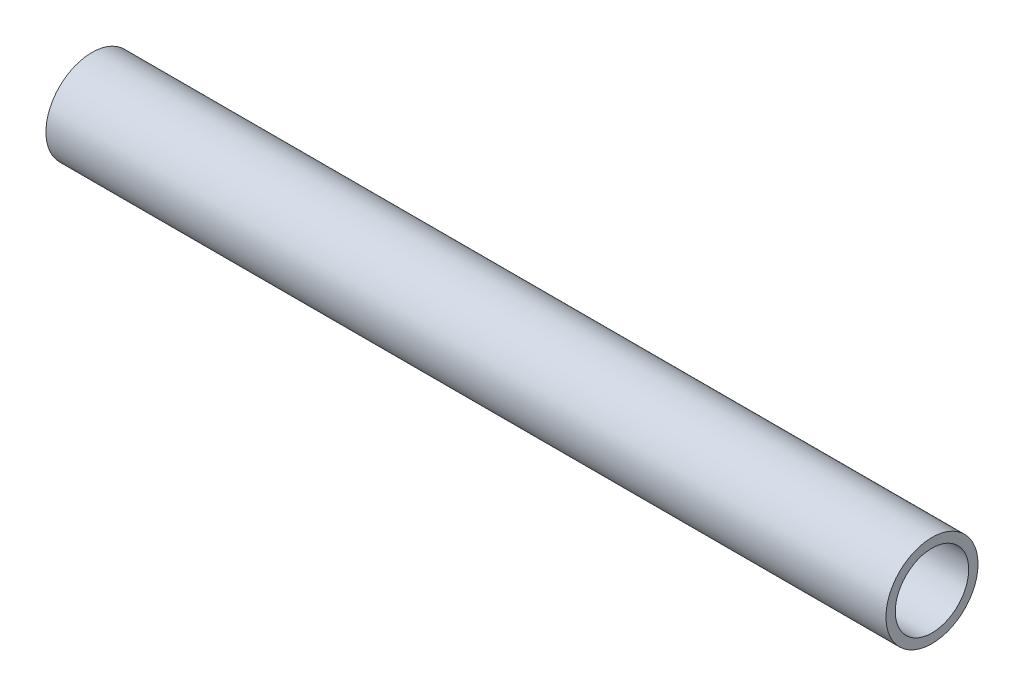
ISO-10303-21;
HEADER;
FILE_DESCRIPTION(('STEP AP214'),'2;1');
FILE_NAME('part.step','',(''),(''),'','','');
FILE_SCHEMA(('AUTOMOTIVE_DESIGN { 1 0 10303 214 1 1 1 1 }'));
ENDSEC;
DATA;
#1=APPLICATION_CONTEXT('core data for automotive mechanical design processes');
#2=APPLICATION_PROTOCOL_DEFINITION('international standard','automotive_design',2000,#1);
#3=PRODUCT_CONTEXT('',#1,'mechanical');
#4=PRODUCT('Part','Part','',(#3));
#5=PRODUCT_RELATED_PRODUCT_CATEGORY('part','',(#4));
#6=PRODUCT_DEFINITION_FORMATION('','',#4);
#7=PRODUCT_DEFINITION_CONTEXT('part definition',#1,'design');
#8=PRODUCT_DEFINITION('design','',#6,#7);
#9=PRODUCT_DEFINITION_SHAPE('','',#8);
#10=(LENGTH_UNIT() NAMED_UNIT(*) SI_UNIT(.MILLI.,.METRE.));
#11=(NAMED_UNIT(*) PLANE_ANGLE_UNIT() SI_UNIT($,.RADIAN.));
#12=(NAMED_UNIT(*) SI_UNIT($,.STERADIAN.) SOLID_ANGLE_UNIT());
#13=UNCERTAINTY_MEASURE_WITH_UNIT(LENGTH_MEASURE(1.E-05),#10,'distance_accuracy_value','');
#14=(GEOMETRIC_REPRESENTATION_CONTEXT(3) GLOBAL_UNCERTAINTY_ASSIGNED_CONTEXT((#13)) GLOBAL_UNIT_ASSIGNED_CONTEXT((#10,
#11,#12)) REPRESENTATION_CONTEXT('',''));
#15=CARTESIAN_POINT('',(0.,0.,0.));
#16=DIRECTION('',(0.,0.,1.));
#17=DIRECTION('',(1.,0.,0.));
#18=AXIS2_PLACEMENT_3D('',#15,#16,#17);
#19=CARTESIAN_POINT('',(0.,0.,-21.04263));
#20=DIRECTION('',(0.,0.,1.));
#21=DIRECTION('',(1.,0.,0.));
#22=AXIS2_PLACEMENT_3D('',#19,#20,#21);
#23=CYLINDRICAL_SURFACE('',#22,2.7051);
#24=CARTESIAN_POINT('',(2.7051,0.,-13.3223));
#25=CARTESIAN_POINT('',(2.705092770252,0.150134895986582,-13.322296453047));
#26=CARTESIAN_POINT('',(2.69254720896019,0.300455599655087,-13.3197336186402));
#27=CARTESIAN_POINT('',(2.64270335476511,0.596966096638184,-13.3097489860963));
#28=CARTESIAN_POINT('',(2.60535620334322,0.743147141080097,-13.3023175974179));
#29=CARTESIAN_POINT('',(2.50710998925604,1.02686798668373,-13.2834258688201));
#30=CARTESIAN_POINT('',(2.44624465733639,1.16441983725732,-13.2719713012418));
#31=CARTESIAN_POINT('',(2.30277724469893,1.4273083525318,-13.2462800387835));
#32=CARTESIAN_POINT('',(2.22018226779195,1.55264899098009,-13.2320442535243));
#33=CARTESIAN_POINT('',(2.03436150008406,1.78937507390252,-13.2021303510161));
#34=CARTESIAN_POINT('',(1.93088889645851,1.90056480475128,-13.1864363217807));
#35=CARTESIAN_POINT('',(1.70677569421369,2.10413997421407,-13.1554893636728));
#36=CARTESIAN_POINT('',(1.58613281446885,2.19652291031611,-13.1402364937343));
#37=CARTESIAN_POINT('',(1.32970892431112,2.36068379215464,-13.1117458561835));
#38=CARTESIAN_POINT('',(1.19379656988398,2.43226039894803,-13.0985283256397));
#39=CARTESIAN_POINT('',(0.911562701666267,2.5514858204215,-13.0758290266845));
#40=CARTESIAN_POINT('',(0.765242339422472,2.59913727750455,-13.0663468457489));
#41=CARTESIAN_POINT('',(0.468434920252348,2.66852907056716,-13.0523514429304));
#42=CARTESIAN_POINT('',(0.318030698908316,2.69061027436591,-13.0477729156619));
#43=CARTESIAN_POINT('',(0.0155878260643236,2.70929368040911,-13.0439067260276));
#44=CARTESIAN_POINT('',(-0.13645065389504,2.70589853120761,-13.0446185136737));
#45=CARTESIAN_POINT('',(-0.435344549658883,2.67400106753337,-13.0511932176885));
#46=CARTESIAN_POINT('',(-0.582243808601909,2.64589053647412,-13.0569757498549));
#47=CARTESIAN_POINT('',(-0.869198069426101,2.56597865941832,-13.0729138151156));
#48=CARTESIAN_POINT('',(-1.00925268321465,2.51417597179322,-13.0830695958541));
#49=CARTESIAN_POINT('',(-1.2796696554048,2.38797658400296,-13.1066919415131));
#50=CARTESIAN_POINT('',(-1.40995750281258,2.31342463475637,-13.1201811305812));
#51=CARTESIAN_POINT('',(-1.65631088764909,2.14395825187431,-13.1489347088269));
#52=CARTESIAN_POINT('',(-1.77237578242939,2.04904289867352,-13.1641991781579));
#53=CARTESIAN_POINT('',(-1.98923970617922,1.83946844350324,-13.1951291813348));
#54=CARTESIAN_POINT('',(-2.08971898241318,1.72447855229776,-13.210796930392));
#55=CARTESIAN_POINT('',(-2.27005761431752,1.47905263453857,-13.2405186714921));
#56=CARTESIAN_POINT('',(-2.34990792691539,1.34860987036524,-13.2545719543112));
#57=CARTESIAN_POINT('',(-2.48677940565961,1.07558481775857,-13.2795191243135));
#58=CARTESIAN_POINT('',(-2.54374477558704,0.932973874931196,-13.2904052720511));
#59=CARTESIAN_POINT('',(-2.63270639279091,0.640117866023641,-13.3077166911979));
#60=CARTESIAN_POINT('',(-2.66475503391298,0.489889530410063,-13.3141513199149));
#61=CARTESIAN_POINT('',(-2.69094744379556,0.282093829017848,-13.3194324809051));
#62=CARTESIAN_POINT('',(-2.69625006560105,0.225818805026408,-13.320505376802));
#63=CARTESIAN_POINT('',(-2.70332770739406,0.113037969108653,-13.3219398046502));
#64=CARTESIAN_POINT('',(-2.7051027223068,0.056532156850444,-13.3223013355783));
#65=CARTESIAN_POINT('',(-2.70509277025201,-0.150134895986582,-13.322296453047));
#66=CARTESIAN_POINT('',(-2.69254720896019,-0.300455599655086,-13.3197336186402));
#67=CARTESIAN_POINT('',(-2.6427033547651,-0.596966096638184,-13.3097489860963));
#68=CARTESIAN_POINT('',(-2.60535620334322,-0.743147141080097,-13.3023175974179));
#69=CARTESIAN_POINT('',(-2.50710998925604,-1.02686798668373,-13.2834258688201));
#70=CARTESIAN_POINT('',(-2.44624465733638,-1.16441983725732,-13.2719713012418));
#71=CARTESIAN_POINT('',(-2.30277724469893,-1.42730835253181,-13.2462800387835));
#72=CARTESIAN_POINT('',(-2.22018226779195,-1.55264899098009,-13.2320442535243));
#73=CARTESIAN_POINT('',(-2.03436150008406,-1.78937507390252,-13.2021303510161));
#74=CARTESIAN_POINT('',(-1.93088889645851,-1.90056480475128,-13.1864363217807));
#75=CARTESIAN_POINT('',(-1.70677569421369,-2.10413997421407,-13.1554893636728));
#76=CARTESIAN_POINT('',(-1.58613281446885,-2.19652291031611,-13.1402364937343));
#77=CARTESIAN_POINT('',(-1.32970892431112,-2.36068379215464,-13.1117458561835));
#78=CARTESIAN_POINT('',(-1.19379656988398,-2.43226039894803,-13.0985283256397));
#79=CARTESIAN_POINT('',(-0.911562701666266,-2.5514858204215,-13.0758290266845));
#80=CARTESIAN_POINT('',(-0.765242339422471,-2.59913727750455,-13.0663468457489));
#81=CARTESIAN_POINT('',(-0.468434920252347,-2.66852907056716,-13.0523514429304));
#82=CARTESIAN_POINT('',(-0.318030698908315,-2.69061027436591,-13.0477729156619));
#83=CARTESIAN_POINT('',(-0.0155878260643225,-2.70929368040911,-13.0439067260276));
#84=CARTESIAN_POINT('',(0.13645065389504,-2.70589853120761,-13.0446185136737));
#85=CARTESIAN_POINT('',(0.435344549658883,-2.67400106753337,-13.0511932176885));
#86=CARTESIAN_POINT('',(0.58224380860191,-2.64589053647411,-13.0569757498549));
#87=CARTESIAN_POINT('',(0.869198069426101,-2.56597865941832,-13.0729138151156));
#88=CARTESIAN_POINT('',(1.00925268321465,-2.51417597179322,-13.0830695958541));
#89=CARTESIAN_POINT('',(1.2796696554048,-2.38797658400296,-13.1066919415131));
#90=CARTESIAN_POINT('',(1.40995750281258,-2.31342463475637,-13.1201811305812));
#91=CARTESIAN_POINT('',(1.65631088764909,-2.14395825187431,-13.1489347088269));
#92=CARTESIAN_POINT('',(1.77237578242939,-2.04904289867352,-13.1641991781579));
#93=CARTESIAN_POINT('',(1.98923970617922,-1.83946844350324,-13.1951291813348));
#94=CARTESIAN_POINT('',(2.08971898241318,-1.72447855229776,-13.210796930392));
#95=CARTESIAN_POINT('',(2.27005761431752,-1.47905263453857,-13.2405186714921));
#96=CARTESIAN_POINT('',(2.34990792691539,-1.34860987036524,-13.2545719543112));
#97=CARTESIAN_POINT('',(2.48677940565961,-1.07558481775857,-13.2795191243135));
#98=CARTESIAN_POINT('',(2.54374477558704,-0.932973874931195,-13.2904052720511));
#99=CARTESIAN_POINT('',(2.63270639279091,-0.64011786602364,-13.3077166911979));
#100=CARTESIAN_POINT('',(2.66475503391298,-0.489889530410063,-13.3141513199149));
#101=CARTESIAN_POINT('',(2.69094744379556,-0.282093829017847,-13.3194324809051));
#102=CARTESIAN_POINT('',(2.69625006560105,-0.225818805026406,-13.320505376802));
#103=CARTESIAN_POINT('',(2.70332770739406,-0.113037969108651,-13.3219398046502));
#104=CARTESIAN_POINT('',(2.7051027223068,-0.0565321568504435,-13.3223013355783));
#105=CARTESIAN_POINT('',(2.7051,0.,-13.3223));
#106=B_SPLINE_CURVE_WITH_KNOTS('',3,(#24,#25,#26,#27,#28,#29,#30,#31,#32,#33,#34,#35,#36,#37,
#38,#39,#40,#41,#42,#43,#44,#45,#46,#47,#48,#49,#50,#51,#52,#53,#54,#55,#56,#57,#58,#59,#60,#61,
#62,#63,#64,#65,#66,#67,#68,#69,#70,#71,#72,#73,#74,#75,#76,#77,#78,#79,#80,#81,#82,#83,#84,#85,
#86,#87,#88,#89,#90,#91,#92,#93,#94,#95,#96,#97,#98,#99,#100,#101,#102,#103,#104,#105),
.UNSPECIFIED.,.T.,.F.,(4,2,2,2,2,2,2,2,2,2,2,2,2,2,2,2,2,2,2,2,2,2,2,2,2,2,2,2,2,2,2,2,2,2,2,2,
2,2,2,2,4),(0.,0.450188523853651,0.901266549267453,1.35170000706144,1.80198639266504,
2.25794583685643,2.71396591334758,3.17426214908979,3.63450753642172,4.08854424314986,
4.54253374829867,4.98945388452447,5.43639933187269,5.88646582195333,6.33655264029962,
6.79491105355946,7.25347005672623,7.71314039330976,8.17184152046139,8.34135635219493,
8.51087142779094,8.96105995164459,9.41213797705839,9.86257143485238,10.312857820456,
10.7688172646474,11.2248373411385,11.6851335768807,12.1453789642127,12.5994156709408,
13.0534051760896,13.5003253123154,13.9472707596636,14.3973372497443,14.8474240680906,
15.3057824813504,15.7643414845172,16.2240118211007,16.6827129482523,16.8522277799859,
17.0217428555819),.UNSPECIFIED.);
#107=CARTESIAN_POINT('',(2.7051,0.,-13.3223));
#108=VERTEX_POINT('',#107);
#109=EDGE_CURVE('E18',#108,#108,#106,.T.);
#110=ORIENTED_EDGE('',*,*,#109,.T.);
#111=EDGE_LOOP('',(#110));
#112=FACE_BOUND('',#111,.T.);
#113=CARTESIAN_POINT('',(-2.7051,0.,-16.7005));
#114=CARTESIAN_POINT('',(-2.70509309409082,-0.150741645900389,-16.7004972167994));
#115=CARTESIAN_POINT('',(-2.69244662908785,-0.301676265418033,-16.6984360194076));
#116=CARTESIAN_POINT('',(-2.64218308153297,-0.599428689470894,-16.6904065962194));
#117=CARTESIAN_POINT('',(-2.60451515704579,-0.746237476213944,-16.6844304157806));
#118=CARTESIAN_POINT('',(-2.50536828429985,-1.03122006902032,-16.6692417315316));
#119=CARTESIAN_POINT('',(-2.44391845032836,-1.16940419428775,-16.660033186124));
#120=CARTESIAN_POINT('',(-2.29901908866841,-1.43344185142085,-16.6393961399459));
#121=CARTESIAN_POINT('',(-2.2155778777378,-1.55930002012176,-16.6279684788355));
#122=CARTESIAN_POINT('',(-2.0282430238249,-1.79632952976378,-16.6040424837561));
#123=CARTESIAN_POINT('',(-1.92418722961853,-1.90737193048535,-16.5915361362649));
#124=CARTESIAN_POINT('',(-1.69892123634819,-2.11050674917163,-16.5669235979439));
#125=CARTESIAN_POINT('',(-1.57770910310208,-2.20259702762346,-16.5548174524225));
#126=CARTESIAN_POINT('',(-1.32070883935374,-2.36571099656375,-16.5323003324469));
#127=CARTESIAN_POINT('',(-1.18484059875069,-2.43660999618289,-16.521899548041));
#128=CARTESIAN_POINT('',(-0.90292816197871,-2.55453071935355,-16.5040798527835));
#129=CARTESIAN_POINT('',(-0.756884703159165,-2.60155417100947,-16.4966607261284));
#130=CARTESIAN_POINT('',(-0.460112840333474,-2.66999045968322,-16.4857227244895));
#131=CARTESIAN_POINT('',(-0.309436250543087,-2.69162255383434,-16.4821704782627));
#132=CARTESIAN_POINT('',(-0.0065530219699816,-2.70934169526446,-16.4792673885162));
#133=CARTESIAN_POINT('',(0.145653516419029,-2.70543040788935,-16.4799162710965));
#134=CARTESIAN_POINT('',(0.445714025154568,-2.67235264694948,-16.4853116310412));
#135=CARTESIAN_POINT('',(0.593595925602119,-2.64343208459313,-16.4900182085378));
#136=CARTESIAN_POINT('',(0.882381537342906,-2.5615419373464,-16.5029362887636));
#137=CARTESIAN_POINT('',(1.02328496344333,-2.5085713704904,-16.5111479346044));
#138=CARTESIAN_POINT('',(1.2948565931111,-2.37983166644533,-16.530194602301));
#139=CARTESIAN_POINT('',(1.42547489103507,-2.30395908225008,-16.5410414830344));
#140=CARTESIAN_POINT('',(1.67220906899206,-2.13164889454298,-16.5641270395111));
#141=CARTESIAN_POINT('',(1.78832496834256,-2.03521131842456,-16.5763657134006));
#142=CARTESIAN_POINT('',(2.00417355744576,-1.82318497653788,-16.6010299041729));
#143=CARTESIAN_POINT('',(2.10370232369518,-1.70738858354495,-16.6134559503886));
#144=CARTESIAN_POINT('',(2.28199165326535,-1.46056854668999,-16.6369703415384));
#145=CARTESIAN_POINT('',(2.36074289873228,-1.32953810881171,-16.6480580850943));
#146=CARTESIAN_POINT('',(2.4952510895887,-1.05574730966822,-16.6676621459182));
#147=CARTESIAN_POINT('',(2.55097187788182,-0.912968922644694,-16.6761744141994));
#148=CARTESIAN_POINT('',(2.63747319436241,-0.620100563644987,-16.689623933451));
#149=CARTESIAN_POINT('',(2.66830632702501,-0.470026728021121,-16.6945687225584));
#150=CARTESIAN_POINT('',(2.69254557599536,-0.265728002248771,-16.698470478202));
#151=CARTESIAN_POINT('',(2.69724972289396,-0.212701194892199,-16.6992299364118));
#152=CARTESIAN_POINT('',(2.70352815565814,-0.106457615956376,-16.7002451890075));
#153=CARTESIAN_POINT('',(2.70510243911649,-0.0532408442310525,-16.7005009830061));
#154=CARTESIAN_POINT('',(2.70509309409083,0.150741645900387,-16.7004972167994));
#155=CARTESIAN_POINT('',(2.69244662908785,0.301676265418031,-16.6984360194076));
#156=CARTESIAN_POINT('',(2.64218308153297,0.599428689470892,-16.6904065962194));
#157=CARTESIAN_POINT('',(2.60451515704579,0.746237476213943,-16.6844304157806));
#158=CARTESIAN_POINT('',(2.50536828429985,1.03122006902032,-16.6692417315316));
#159=CARTESIAN_POINT('',(2.44391845032837,1.16940419428775,-16.660033186124));
#160=CARTESIAN_POINT('',(2.29901908866841,1.43344185142085,-16.6393961399459));
#161=CARTESIAN_POINT('',(2.2155778777378,1.55930002012176,-16.6279684788355));
#162=CARTESIAN_POINT('',(2.0282430238249,1.79632952976378,-16.6040424837561));
#163=CARTESIAN_POINT('',(1.92418722961853,1.90737193048535,-16.5915361362649));
#164=CARTESIAN_POINT('',(1.69892123634819,2.11050674917163,-16.5669235979439));
#165=CARTESIAN_POINT('',(1.57770910310208,2.20259702762346,-16.5548174524225));
#166=CARTESIAN_POINT('',(1.32070883935374,2.36571099656375,-16.5323003324469));
#167=CARTESIAN_POINT('',(1.18484059875069,2.43660999618289,-16.521899548041));
#168=CARTESIAN_POINT('',(0.902928161978712,2.55453071935355,-16.5040798527835));
#169=CARTESIAN_POINT('',(0.756884703159167,2.60155417100947,-16.4966607261284));
#170=CARTESIAN_POINT('',(0.460112840333476,2.66999045968322,-16.4857227244895));
#171=CARTESIAN_POINT('',(0.309436250543088,2.69162255383434,-16.4821704782627));
#172=CARTESIAN_POINT('',(0.0065530219699829,2.70934169526446,-16.4792673885162));
#173=CARTESIAN_POINT('',(-0.145653516419027,2.70543040788935,-16.4799162710965));
#174=CARTESIAN_POINT('',(-0.445714025154566,2.67235264694948,-16.4853116310412));
#175=CARTESIAN_POINT('',(-0.593595925602117,2.64343208459313,-16.4900182085378));
#176=CARTESIAN_POINT('',(-0.882381537342904,2.5615419373464,-16.5029362887636));
#177=CARTESIAN_POINT('',(-1.02328496344333,2.5085713704904,-16.5111479346044));
#178=CARTESIAN_POINT('',(-1.2948565931111,2.37983166644533,-16.530194602301));
#179=CARTESIAN_POINT('',(-1.42547489103506,2.30395908225008,-16.5410414830344));
#180=CARTESIAN_POINT('',(-1.67220906899206,2.13164889454298,-16.5641270395111));
#181=CARTESIAN_POINT('',(-1.78832496834256,2.03521131842456,-16.5763657134006));
#182=CARTESIAN_POINT('',(-2.00417355744576,1.82318497653788,-16.6010299041729));
#183=CARTESIAN_POINT('',(-2.10370232369518,1.70738858354495,-16.6134559503886));
#184=CARTESIAN_POINT('',(-2.28199165326535,1.46056854668999,-16.6369703415384));
#185=CARTESIAN_POINT('',(-2.36074289873228,1.32953810881171,-16.6480580850943));
#186=CARTESIAN_POINT('',(-2.4952510895887,1.05574730966822,-16.6676621459182));
#187=CARTESIAN_POINT('',(-2.55097187788182,0.912968922644696,-16.6761744141994));
#188=CARTESIAN_POINT('',(-2.63747319436241,0.620100563644988,-16.689623933451));
#189=CARTESIAN_POINT('',(-2.66830632702501,0.470026728021122,-16.6945687225584));
#190=CARTESIAN_POINT('',(-2.69254557599536,0.265728002248771,-16.698470478202));
#191=CARTESIAN_POINT('',(-2.69724972289396,0.212701194892198,-16.6992299364118));
#192=CARTESIAN_POINT('',(-2.70352815565814,0.106457615956374,-16.7002451890075));
#193=CARTESIAN_POINT('',(-2.70510243911649,0.0532408442310505,-16.7005009830061));
#194=CARTESIAN_POINT('',(-2.7051,0.,-16.7005));
#195=B_SPLINE_CURVE_WITH_KNOTS('',3,(#113,#114,#115,#116,#117,#118,#119,#120,#121,#122,#123,
#124,#125,#126,#127,#128,#129,#130,#131,#132,#133,#134,#135,#136,#137,#138,#139,#140,#141,#142,
#143,#144,#145,#146,#147,#148,#149,#150,#151,#152,#153,#154,#155,#156,#157,#158,#159,#160,#161,
#162,#163,#164,#165,#166,#167,#168,#169,#170,#171,#172,#173,#174,#175,#176,#177,#178,#179,#180,
#181,#182,#183,#184,#185,#186,#187,#188,#189,#190,#191,#192,#193,#194),.UNSPECIFIED.,.T.,.F.,(4,
2,2,2,2,2,2,2,2,2,2,2,2,2,2,2,2,2,2,2,2,2,2,2,2,2,2,2,2,2,2,2,2,2,2,2,2,2,2,2,4),(0.,
0.452021756707174,0.904964812536633,1.35735511158987,1.80957456935384,2.26550345577038,
2.72148378398677,3.18009657555907,3.63867616815269,4.09326604447021,4.54782628329346,
4.99796709718931,5.44812629206122,5.90035005434439,6.3525732142505,6.81000074402256,
7.26763306366753,7.72598114739338,8.1833578753983,8.34300852326367,8.50265929391929,
8.95468105062646,9.40762410645592,9.86001440550916,10.3122338632731,10.7681627496897,
11.2241430779061,11.6827558694783,12.141335462072,12.5959253383895,13.0504855772127,
13.5006263911086,13.9507855859805,14.4030093482637,14.8552325081698,15.3126600379418,
15.7702923575868,16.2286404413127,16.6860171693176,16.845667817183,17.0053185878386),.UNSPECIFIED.);
#196=CARTESIAN_POINT('',(-2.7051,0.,-16.7005));
#197=VERTEX_POINT('',#196);
#198=EDGE_CURVE('E34',#197,#197,#195,.T.);
#199=ORIENTED_EDGE('',*,*,#198,.F.);
#200=EDGE_LOOP('',(#199));
#201=FACE_BOUND('',#200,.T.);
#202=ADVANCED_FACE('F14',(#112,#201),#23,.F.);
#203=CARTESIAN_POINT('',(-152.4,0.,0.));
#204=DIRECTION('',(1.,0.,0.));
#205=DIRECTION('',(0.,0.,-1.));
#206=AXIS2_PLACEMENT_3D('',#203,#204,#205);
#207=CYLINDRICAL_SURFACE('',#206,13.3223);
#208=CARTESIAN_POINT('',(152.4,0.,0.));
#209=DIRECTION('',(1.,0.,0.));
#210=DIRECTION('',(0.,0.,-1.));
#211=AXIS2_PLACEMENT_3D('',#208,#209,#210);
#212=CIRCLE('',#211,13.3223);
#213=CARTESIAN_POINT('',(152.4,0.,-13.3223));
#214=VERTEX_POINT('',#213);
#215=EDGE_CURVE('E39',#214,#214,#212,.F.);
#216=ORIENTED_EDGE('',*,*,#215,.F.);
#217=EDGE_LOOP('',(#216));
#218=FACE_BOUND('',#217,.T.);
#219=ORIENTED_EDGE('',*,*,#109,.F.);
#220=EDGE_LOOP('',(#219));
#221=FACE_BOUND('',#220,.T.);
#222=CARTESIAN_POINT('',(-152.4,0.,0.));
#223=DIRECTION('',(1.,0.,0.));
#224=DIRECTION('',(0.,0.,-1.));
#225=AXIS2_PLACEMENT_3D('',#222,#223,#224);
#226=CIRCLE('',#225,13.3223);
#227=CARTESIAN_POINT('',(-152.4,0.,-13.3223));
#228=VERTEX_POINT('',#227);
#229=EDGE_CURVE('E29',#228,#228,#226,.F.);
#230=ORIENTED_EDGE('',*,*,#229,.T.);
#231=EDGE_LOOP('',(#230));
#232=FACE_BOUND('',#231,.T.);
#233=ADVANCED_FACE('F51',(#218,#221,#232),#207,.F.);
#234=CARTESIAN_POINT('',(152.4,0.,0.));
#235=DIRECTION('',(1.,0.,0.));
#236=DIRECTION('',(0.,0.,-1.));
#237=AXIS2_PLACEMENT_3D('',#234,#235,#236);
#238=PLANE('',#237);
#239=ORIENTED_EDGE('',*,*,#215,.T.);
#240=EDGE_LOOP('',(#239));
#241=FACE_BOUND('',#240,.T.);
#242=CARTESIAN_POINT('',(152.4,0.,0.));
#243=DIRECTION('',(1.,0.,0.));
#244=DIRECTION('',(0.,0.,-1.));
#245=AXIS2_PLACEMENT_3D('',#242,#243,#244);
#246=CIRCLE('',#245,16.7005);
#247=CARTESIAN_POINT('',(152.4,0.,-16.7005));
#248=VERTEX_POINT('',#247);
#249=EDGE_CURVE('E24',#248,#248,#246,.F.);
#250=ORIENTED_EDGE('',*,*,#249,.F.);
#251=EDGE_LOOP('',(#250));
#252=FACE_BOUND('',#251,.T.);
#253=ADVANCED_FACE('F48',(#241,#252),#238,.T.);
#254=CARTESIAN_POINT('',(-152.4,0.,0.));
#255=DIRECTION('',(1.,0.,0.));
#256=DIRECTION('',(0.,0.,-1.));
#257=AXIS2_PLACEMENT_3D('',#254,#255,#256);
#258=PLANE('',#257);
#259=ORIENTED_EDGE('',*,*,#229,.F.);
#260=EDGE_LOOP('',(#259));
#261=FACE_BOUND('',#260,.T.);
#262=CARTESIAN_POINT('',(-152.4,0.,0.));
#263=DIRECTION('',(1.,0.,0.));
#264=DIRECTION('',(0.,0.,-1.));
#265=AXIS2_PLACEMENT_3D('',#262,#263,#264);
#266=CIRCLE('',#265,16.7005);
#267=CARTESIAN_POINT('',(-152.4,0.,-16.7005));
#268=VERTEX_POINT('',#267);
#269=EDGE_CURVE('E10',#268,#268,#266,.T.);
#270=ORIENTED_EDGE('',*,*,#269,.F.);
#271=EDGE_LOOP('',(#270));
#272=FACE_BOUND('',#271,.T.);
#273=ADVANCED_FACE('F44',(#261,#272),#258,.F.);
#274=CARTESIAN_POINT('',(-152.4,0.,0.));
#275=DIRECTION('',(1.,0.,0.));
#276=DIRECTION('',(0.,0.,-1.));
#277=AXIS2_PLACEMENT_3D('',#274,#275,#276);
#278=CYLINDRICAL_SURFACE('',#277,16.7005);
#279=ORIENTED_EDGE('',*,*,#249,.T.);
#280=EDGE_LOOP('',(#279));
#281=FACE_BOUND('',#280,.T.);
#282=ORIENTED_EDGE('',*,*,#269,.T.);
#283=EDGE_LOOP('',(#282));
#284=FACE_BOUND('',#283,.T.);
#285=ORIENTED_EDGE('',*,*,#198,.T.);
#286=EDGE_LOOP('',(#285));
#287=FACE_BOUND('',#286,.T.);
#288=ADVANCED_FACE('F40',(#281,#284,#287),#278,.T.);
#289=CLOSED_SHELL('',(#202,#233,#253,#273,#288));
#290=MANIFOLD_SOLID_BREP('B1',#289);
#291=ADVANCED_BREP_SHAPE_REPRESENTATION('',(#18,#290),#14);
#292=SHAPE_DEFINITION_REPRESENTATION(#9,#291);
ENDSEC;
END-ISO-10303-21;
